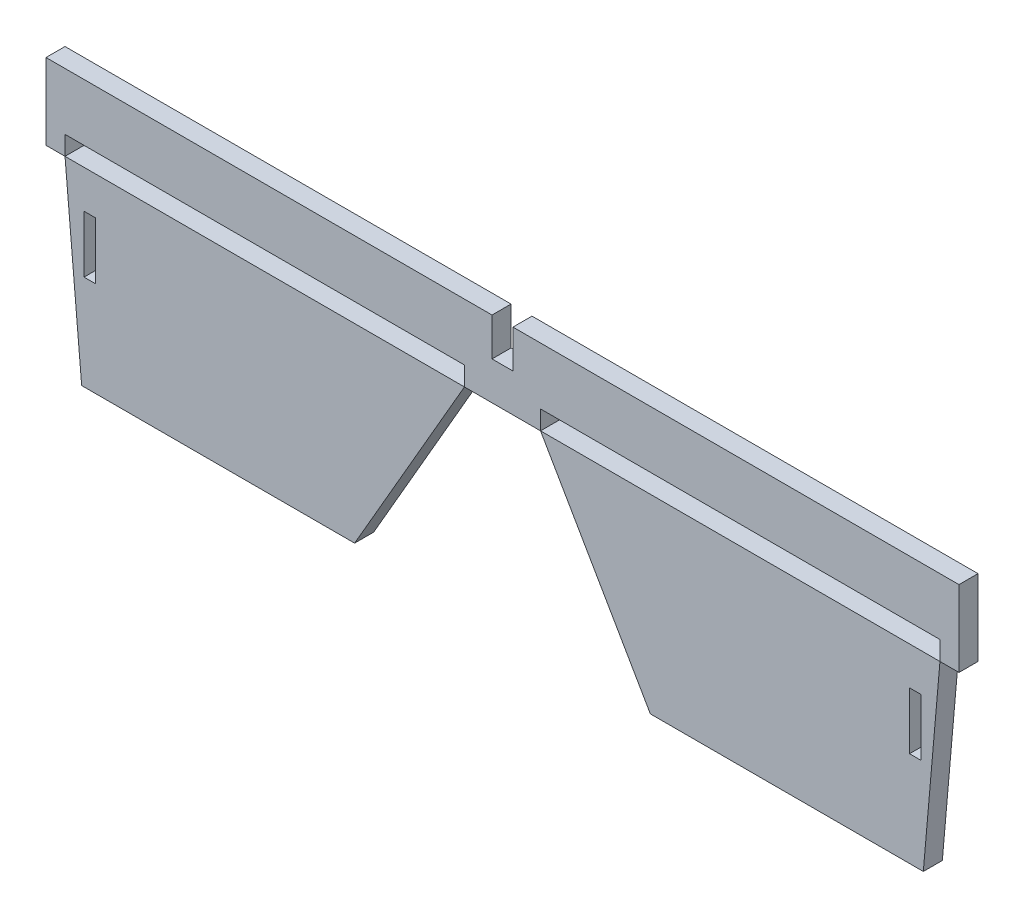
ISO-10303-21;
HEADER;
FILE_DESCRIPTION(('STEP AP214'),'2;1');
FILE_NAME('part.step','',(''),(''),'','','');
FILE_SCHEMA(('AUTOMOTIVE_DESIGN { 1 0 10303 214 1 1 1 1 }'));
ENDSEC;
DATA;
#1=APPLICATION_CONTEXT('core data for automotive mechanical design processes');
#2=APPLICATION_PROTOCOL_DEFINITION('international standard','automotive_design',2000,#1);
#3=PRODUCT_CONTEXT('',#1,'mechanical');
#4=PRODUCT('Part','Part','',(#3));
#5=PRODUCT_RELATED_PRODUCT_CATEGORY('part','',(#4));
#6=PRODUCT_DEFINITION_FORMATION('','',#4);
#7=PRODUCT_DEFINITION_CONTEXT('part definition',#1,'design');
#8=PRODUCT_DEFINITION('design','',#6,#7);
#9=PRODUCT_DEFINITION_SHAPE('','',#8);
#10=(LENGTH_UNIT() NAMED_UNIT(*) SI_UNIT(.MILLI.,.METRE.));
#11=(NAMED_UNIT(*) PLANE_ANGLE_UNIT() SI_UNIT($,.RADIAN.));
#12=(NAMED_UNIT(*) SI_UNIT($,.STERADIAN.) SOLID_ANGLE_UNIT());
#13=UNCERTAINTY_MEASURE_WITH_UNIT(LENGTH_MEASURE(1.E-05),#10,'distance_accuracy_value','');
#14=(GEOMETRIC_REPRESENTATION_CONTEXT(3) GLOBAL_UNCERTAINTY_ASSIGNED_CONTEXT((#13)) GLOBAL_UNIT_ASSIGNED_CONTEXT((#10,
#11,#12)) REPRESENTATION_CONTEXT('',''));
#15=CARTESIAN_POINT('',(0.,0.,0.));
#16=DIRECTION('',(0.,0.,1.));
#17=DIRECTION('',(1.,0.,0.));
#18=AXIS2_PLACEMENT_3D('',#15,#16,#17);
#19=CARTESIAN_POINT('',(0.,-20.,2.5));
#20=DIRECTION('',(0.,1.,0.));
#21=DIRECTION('',(0.,0.,1.));
#22=AXIS2_PLACEMENT_3D('',#19,#20,#21);
#23=PLANE('',#22);
#24=DIRECTION('',(-1.,0.,0.));
#25=VECTOR('',#24,1.);
#26=CARTESIAN_POINT('',(0.,-20.,-2.5));
#27=LINE('',#26,#25);
#28=CARTESIAN_POINT('',(110.,-20.,-2.5));
#29=VERTEX_POINT('',#28);
#30=CARTESIAN_POINT('',(107.,-20.,-2.5));
#31=VERTEX_POINT('',#30);
#32=EDGE_CURVE('E154',#29,#31,#27,.T.);
#33=ORIENTED_EDGE('',*,*,#32,.F.);
#34=DIRECTION('',(0.,0.,-1.));
#35=VECTOR('',#34,1.);
#36=CARTESIAN_POINT('',(110.,-20.,2.5));
#37=LINE('',#36,#35);
#38=CARTESIAN_POINT('',(110.,-20.,2.5));
#39=VERTEX_POINT('',#38);
#40=EDGE_CURVE('E161',#39,#29,#37,.T.);
#41=ORIENTED_EDGE('',*,*,#40,.F.);
#42=DIRECTION('',(-1.,0.,0.));
#43=VECTOR('',#42,1.);
#44=CARTESIAN_POINT('',(0.,-20.,2.5));
#45=LINE('',#44,#43);
#46=CARTESIAN_POINT('',(107.,-20.,2.5));
#47=VERTEX_POINT('',#46);
#48=EDGE_CURVE('E136',#39,#47,#45,.T.);
#49=ORIENTED_EDGE('',*,*,#48,.T.);
#50=DIRECTION('',(0.,0.,-1.));
#51=VECTOR('',#50,1.);
#52=CARTESIAN_POINT('',(107.,-20.,2.5));
#53=LINE('',#52,#51);
#54=EDGE_CURVE('E12',#47,#31,#53,.T.);
#55=ORIENTED_EDGE('',*,*,#54,.T.);
#56=EDGE_LOOP('',(#33,#41,#49,#55));
#57=FACE_BOUND('',#56,.T.);
#58=ADVANCED_FACE('F46',(#57),#23,.F.);
#59=CARTESIAN_POINT('',(107.,0.,2.5));
#60=DIRECTION('',(-1.,0.,0.));
#61=DIRECTION('',(0.,0.,-1.));
#62=AXIS2_PLACEMENT_3D('',#59,#60,#61);
#63=PLANE('',#62);
#64=DIRECTION('',(0.,-1.,0.));
#65=VECTOR('',#64,1.);
#66=CARTESIAN_POINT('',(107.,0.,-2.5));
#67=LINE('',#66,#65);
#68=CARTESIAN_POINT('',(107.,-35.,-2.5));
#69=VERTEX_POINT('',#68);
#70=EDGE_CURVE('E156',#31,#69,#67,.T.);
#71=ORIENTED_EDGE('',*,*,#70,.F.);
#72=ORIENTED_EDGE('',*,*,#54,.F.);
#73=DIRECTION('',(0.,-1.,0.));
#74=VECTOR('',#73,1.);
#75=CARTESIAN_POINT('',(107.,0.,2.5));
#76=LINE('',#75,#74);
#77=CARTESIAN_POINT('',(107.,-35.,2.5));
#78=VERTEX_POINT('',#77);
#79=EDGE_CURVE('E123',#47,#78,#76,.T.);
#80=ORIENTED_EDGE('',*,*,#79,.T.);
#81=DIRECTION('',(0.,0.,-1.));
#82=VECTOR('',#81,1.);
#83=CARTESIAN_POINT('',(107.,-35.,2.5));
#84=LINE('',#83,#82);
#85=EDGE_CURVE('E56',#78,#69,#84,.T.);
#86=ORIENTED_EDGE('',*,*,#85,.T.);
#87=EDGE_LOOP('',(#71,#72,#80,#86));
#88=FACE_BOUND('',#87,.T.);
#89=ADVANCED_FACE('F134',(#88),#63,.F.);
#90=CARTESIAN_POINT('',(0.,-35.,2.5));
#91=DIRECTION('',(0.,1.,0.));
#92=DIRECTION('',(0.,0.,1.));
#93=AXIS2_PLACEMENT_3D('',#90,#91,#92);
#94=PLANE('',#93);
#95=DIRECTION('',(-1.,0.,0.));
#96=VECTOR('',#95,1.);
#97=CARTESIAN_POINT('',(0.,-35.,-2.5));
#98=LINE('',#97,#96);
#99=CARTESIAN_POINT('',(110.,-35.,-2.5));
#100=VERTEX_POINT('',#99);
#101=EDGE_CURVE('E129',#100,#69,#98,.T.);
#102=ORIENTED_EDGE('',*,*,#101,.T.);
#103=ORIENTED_EDGE('',*,*,#85,.F.);
#104=DIRECTION('',(-1.,0.,0.));
#105=VECTOR('',#104,1.);
#106=CARTESIAN_POINT('',(0.,-35.,2.5));
#107=LINE('',#106,#105);
#108=CARTESIAN_POINT('',(110.,-35.,2.5));
#109=VERTEX_POINT('',#108);
#110=EDGE_CURVE('E119',#109,#78,#107,.T.);
#111=ORIENTED_EDGE('',*,*,#110,.F.);
#112=DIRECTION('',(0.,0.,-1.));
#113=VECTOR('',#112,1.);
#114=CARTESIAN_POINT('',(110.,-35.,2.5));
#115=LINE('',#114,#113);
#116=EDGE_CURVE('E132',#109,#100,#115,.T.);
#117=ORIENTED_EDGE('',*,*,#116,.T.);
#118=EDGE_LOOP('',(#102,#103,#111,#117));
#119=FACE_BOUND('',#118,.T.);
#120=ADVANCED_FACE('F128',(#119),#94,.T.);
#121=CARTESIAN_POINT('',(114.994686686537,-10.0607314507871,2.5));
#122=DIRECTION('',(-0.996194698091746,0.0871557427476551,0.));
#123=DIRECTION('',(0.0871557427476551,0.996194698091746,0.));
#124=AXIS2_PLACEMENT_3D('',#121,#122,#123);
#125=PLANE('',#124);
#126=DIRECTION('',(-0.0871557427476551,-0.996194698091746,0.));
#127=VECTOR('',#126,1.);
#128=CARTESIAN_POINT('',(114.994686686537,-10.0607314507871,-2.5));
#129=LINE('',#128,#127);
#130=CARTESIAN_POINT('',(115.,-10.,-2.5));
#131=VERTEX_POINT('',#130);
#132=CARTESIAN_POINT('',(110.625566823704,-60.,-2.5));
#133=VERTEX_POINT('',#132);
#134=EDGE_CURVE('E144',#131,#133,#129,.T.);
#135=ORIENTED_EDGE('',*,*,#134,.F.);
#136=DIRECTION('',(0.,0.,-1.));
#137=VECTOR('',#136,1.);
#138=CARTESIAN_POINT('',(115.,-10.,2.5));
#139=LINE('',#138,#137);
#140=CARTESIAN_POINT('',(115.,-10.,2.5));
#141=VERTEX_POINT('',#140);
#142=EDGE_CURVE('E143',#141,#131,#139,.T.);
#143=ORIENTED_EDGE('',*,*,#142,.F.);
#144=DIRECTION('',(-0.0871557427476551,-0.996194698091746,0.));
#145=VECTOR('',#144,1.);
#146=CARTESIAN_POINT('',(114.994686686537,-10.0607314507871,2.5));
#147=LINE('',#146,#145);
#148=CARTESIAN_POINT('',(110.625566823704,-60.,2.5));
#149=VERTEX_POINT('',#148);
#150=EDGE_CURVE('E160',#141,#149,#147,.T.);
#151=ORIENTED_EDGE('',*,*,#150,.T.);
#152=DIRECTION('',(0.,0.,-1.));
#153=VECTOR('',#152,1.);
#154=CARTESIAN_POINT('',(110.625566823704,-60.,2.5));
#155=LINE('',#154,#153);
#156=EDGE_CURVE('E50',#149,#133,#155,.T.);
#157=ORIENTED_EDGE('',*,*,#156,.T.);
#158=EDGE_LOOP('',(#135,#143,#151,#157));
#159=FACE_BOUND('',#158,.T.);
#160=ADVANCED_FACE('F48',(#159),#125,.F.);
#161=CARTESIAN_POINT('',(0.,-60.,2.5));
#162=DIRECTION('',(0.,1.,0.));
#163=DIRECTION('',(0.,0.,1.));
#164=AXIS2_PLACEMENT_3D('',#161,#162,#163);
#165=PLANE('',#164);
#166=DIRECTION('',(-1.,0.,0.));
#167=VECTOR('',#166,1.);
#168=CARTESIAN_POINT('',(0.,-60.,-2.5));
#169=LINE('',#168,#167);
#170=CARTESIAN_POINT('',(38.8675134594816,-60.,-2.5));
#171=VERTEX_POINT('',#170);
#172=EDGE_CURVE('E147',#133,#171,#169,.T.);
#173=ORIENTED_EDGE('',*,*,#172,.F.);
#174=ORIENTED_EDGE('',*,*,#156,.F.);
#175=DIRECTION('',(-1.,0.,0.));
#176=VECTOR('',#175,1.);
#177=CARTESIAN_POINT('',(0.,-60.,2.5));
#178=LINE('',#177,#176);
#179=CARTESIAN_POINT('',(38.8675134594816,-60.,2.5));
#180=VERTEX_POINT('',#179);
#181=EDGE_CURVE('E104',#149,#180,#178,.T.);
#182=ORIENTED_EDGE('',*,*,#181,.T.);
#183=DIRECTION('',(0.,0.,-1.));
#184=VECTOR('',#183,1.);
#185=CARTESIAN_POINT('',(38.8675134594816,-60.,2.5));
#186=LINE('',#185,#184);
#187=EDGE_CURVE('E168',#180,#171,#186,.T.);
#188=ORIENTED_EDGE('',*,*,#187,.T.);
#189=EDGE_LOOP('',(#173,#174,#182,#188));
#190=FACE_BOUND('',#189,.T.);
#191=ADVANCED_FACE('F190',(#190),#165,.F.);
#192=CARTESIAN_POINT('',(3.16987298107774,1.83012701892218,2.5));
#193=DIRECTION('',(-0.866025403784436,-0.500000000000004,0.));
#194=DIRECTION('',(-0.500000000000004,0.866025403784436,0.));
#195=AXIS2_PLACEMENT_3D('',#192,#193,#194);
#196=PLANE('',#195);
#197=DIRECTION('',(0.500000000000004,-0.866025403784436,0.));
#198=VECTOR('',#197,1.);
#199=CARTESIAN_POINT('',(3.16987298107774,1.83012701892218,-2.5));
#200=LINE('',#199,#198);
#201=CARTESIAN_POINT('',(10.,-10.,-2.5));
#202=VERTEX_POINT('',#201);
#203=EDGE_CURVE('E150',#202,#171,#200,.T.);
#204=ORIENTED_EDGE('',*,*,#203,.T.);
#205=ORIENTED_EDGE('',*,*,#187,.F.);
#206=DIRECTION('',(0.500000000000004,-0.866025403784436,0.));
#207=VECTOR('',#206,1.);
#208=CARTESIAN_POINT('',(3.16987298107774,1.83012701892218,2.5));
#209=LINE('',#208,#207);
#210=CARTESIAN_POINT('',(10.,-10.,2.5));
#211=VERTEX_POINT('',#210);
#212=EDGE_CURVE('E184',#211,#180,#209,.T.);
#213=ORIENTED_EDGE('',*,*,#212,.F.);
#214=DIRECTION('',(0.,0.,-1.));
#215=VECTOR('',#214,1.);
#216=CARTESIAN_POINT('',(10.,-10.,2.5));
#217=LINE('',#216,#215);
#218=EDGE_CURVE('E166',#211,#202,#217,.T.);
#219=ORIENTED_EDGE('',*,*,#218,.T.);
#220=EDGE_LOOP('',(#204,#205,#213,#219));
#221=FACE_BOUND('',#220,.T.);
#222=ADVANCED_FACE('F189',(#221),#196,.T.);
#223=CARTESIAN_POINT('',(0.,-10.,2.5));
#224=DIRECTION('',(0.,1.,0.));
#225=DIRECTION('',(0.,0.,1.));
#226=AXIS2_PLACEMENT_3D('',#223,#224,#225);
#227=PLANE('',#226);
#228=DIRECTION('',(-1.,0.,0.));
#229=VECTOR('',#228,1.);
#230=CARTESIAN_POINT('',(0.,-10.,-2.5));
#231=LINE('',#230,#229);
#232=EDGE_CURVE('E152',#131,#202,#231,.T.);
#233=ORIENTED_EDGE('',*,*,#232,.T.);
#234=ORIENTED_EDGE('',*,*,#218,.F.);
#235=DIRECTION('',(-1.,0.,0.));
#236=VECTOR('',#235,1.);
#237=CARTESIAN_POINT('',(0.,-10.,2.5));
#238=LINE('',#237,#236);
#239=EDGE_CURVE('E138',#141,#211,#238,.T.);
#240=ORIENTED_EDGE('',*,*,#239,.F.);
#241=ORIENTED_EDGE('',*,*,#142,.T.);
#242=EDGE_LOOP('',(#233,#234,#240,#241));
#243=FACE_BOUND('',#242,.T.);
#244=ADVANCED_FACE('F182',(#243),#227,.T.);
#245=CARTESIAN_POINT('',(110.,0.,2.5));
#246=DIRECTION('',(-1.,0.,0.));
#247=DIRECTION('',(0.,0.,-1.));
#248=AXIS2_PLACEMENT_3D('',#245,#246,#247);
#249=PLANE('',#248);
#250=DIRECTION('',(0.,-1.,0.));
#251=VECTOR('',#250,1.);
#252=CARTESIAN_POINT('',(110.,0.,-2.5));
#253=LINE('',#252,#251);
#254=EDGE_CURVE('E91',#29,#100,#253,.T.);
#255=ORIENTED_EDGE('',*,*,#254,.T.);
#256=ORIENTED_EDGE('',*,*,#116,.F.);
#257=DIRECTION('',(0.,-1.,0.));
#258=VECTOR('',#257,1.);
#259=CARTESIAN_POINT('',(110.,0.,2.5));
#260=LINE('',#259,#258);
#261=EDGE_CURVE('E65',#39,#109,#260,.T.);
#262=ORIENTED_EDGE('',*,*,#261,.F.);
#263=ORIENTED_EDGE('',*,*,#40,.T.);
#264=EDGE_LOOP('',(#255,#256,#262,#263));
#265=FACE_BOUND('',#264,.T.);
#266=ADVANCED_FACE('F208',(#265),#249,.T.);
#267=CARTESIAN_POINT('',(0.,0.,2.5));
#268=DIRECTION('',(0.,0.,1.));
#269=DIRECTION('',(-1.,0.,0.));
#270=AXIS2_PLACEMENT_3D('',#267,#268,#269);
#271=PLANE('',#270);
#272=ORIENTED_EDGE('',*,*,#150,.F.);
#273=ORIENTED_EDGE('',*,*,#239,.T.);
#274=ORIENTED_EDGE('',*,*,#212,.T.);
#275=ORIENTED_EDGE('',*,*,#181,.F.);
#276=EDGE_LOOP('',(#272,#273,#274,#275));
#277=FACE_BOUND('',#276,.T.);
#278=ORIENTED_EDGE('',*,*,#48,.F.);
#279=ORIENTED_EDGE('',*,*,#261,.T.);
#280=ORIENTED_EDGE('',*,*,#110,.T.);
#281=ORIENTED_EDGE('',*,*,#79,.F.);
#282=EDGE_LOOP('',(#278,#279,#280,#281));
#283=FACE_BOUND('',#282,.T.);
#284=ADVANCED_FACE('F121',(#277,#283),#271,.T.);
#285=CARTESIAN_POINT('',(0.,0.,-2.5));
#286=DIRECTION('',(0.,0.,1.));
#287=DIRECTION('',(-1.,0.,0.));
#288=AXIS2_PLACEMENT_3D('',#285,#286,#287);
#289=PLANE('',#288);
#290=ORIENTED_EDGE('',*,*,#134,.T.);
#291=ORIENTED_EDGE('',*,*,#172,.T.);
#292=ORIENTED_EDGE('',*,*,#203,.F.);
#293=ORIENTED_EDGE('',*,*,#232,.F.);
#294=EDGE_LOOP('',(#290,#291,#292,#293));
#295=FACE_BOUND('',#294,.T.);
#296=ORIENTED_EDGE('',*,*,#32,.T.);
#297=ORIENTED_EDGE('',*,*,#70,.T.);
#298=ORIENTED_EDGE('',*,*,#101,.F.);
#299=ORIENTED_EDGE('',*,*,#254,.F.);
#300=EDGE_LOOP('',(#296,#297,#298,#299));
#301=FACE_BOUND('',#300,.T.);
#302=ADVANCED_FACE('F178',(#295,#301),#289,.F.);
#303=CLOSED_SHELL('',(#58,#89,#120,#160,#191,#222,#244,#266,#284,#302));
#304=MANIFOLD_SOLID_BREP('B2',#303);
#305=CARTESIAN_POINT('',(0.,-20.,2.5));
#306=DIRECTION('',(0.,1.,0.));
#307=DIRECTION('',(0.,0.,1.));
#308=AXIS2_PLACEMENT_3D('',#305,#306,#307);
#309=PLANE('',#308);
#310=DIRECTION('',(1.,0.,0.));
#311=VECTOR('',#310,1.);
#312=CARTESIAN_POINT('',(0.,-20.,-2.5));
#313=LINE('',#312,#311);
#314=CARTESIAN_POINT('',(-110.,-20.,-2.5));
#315=VERTEX_POINT('',#314);
#316=CARTESIAN_POINT('',(-107.,-20.,-2.5));
#317=VERTEX_POINT('',#316);
#318=EDGE_CURVE('E400',#315,#317,#313,.T.);
#319=ORIENTED_EDGE('',*,*,#318,.T.);
#320=DIRECTION('',(0.,0.,-1.));
#321=VECTOR('',#320,1.);
#322=CARTESIAN_POINT('',(-107.,-20.,2.5));
#323=LINE('',#322,#321);
#324=CARTESIAN_POINT('',(-107.,-20.,2.5));
#325=VERTEX_POINT('',#324);
#326=EDGE_CURVE('E44',#325,#317,#323,.T.);
#327=ORIENTED_EDGE('',*,*,#326,.F.);
#328=DIRECTION('',(1.,0.,0.));
#329=VECTOR('',#328,1.);
#330=CARTESIAN_POINT('',(0.,-20.,2.5));
#331=LINE('',#330,#329);
#332=CARTESIAN_POINT('',(-110.,-20.,2.5));
#333=VERTEX_POINT('',#332);
#334=EDGE_CURVE('E371',#333,#325,#331,.T.);
#335=ORIENTED_EDGE('',*,*,#334,.F.);
#336=DIRECTION('',(0.,0.,-1.));
#337=VECTOR('',#336,1.);
#338=CARTESIAN_POINT('',(-110.,-20.,2.5));
#339=LINE('',#338,#337);
#340=EDGE_CURVE('E310',#333,#315,#339,.T.);
#341=ORIENTED_EDGE('',*,*,#340,.T.);
#342=EDGE_LOOP('',(#319,#327,#335,#341));
#343=FACE_BOUND('',#342,.T.);
#344=ADVANCED_FACE('F291',(#343),#309,.F.);
#345=CARTESIAN_POINT('',(-107.,0.,2.5));
#346=DIRECTION('',(1.,0.,0.));
#347=DIRECTION('',(0.,0.,-1.));
#348=AXIS2_PLACEMENT_3D('',#345,#346,#347);
#349=PLANE('',#348);
#350=DIRECTION('',(0.,-1.,0.));
#351=VECTOR('',#350,1.);
#352=CARTESIAN_POINT('',(-107.,0.,-2.5));
#353=LINE('',#352,#351);
#354=CARTESIAN_POINT('',(-107.,-35.,-2.5));
#355=VERTEX_POINT('',#354);
#356=EDGE_CURVE('E377',#317,#355,#353,.T.);
#357=ORIENTED_EDGE('',*,*,#356,.T.);
#358=DIRECTION('',(0.,0.,-1.));
#359=VECTOR('',#358,1.);
#360=CARTESIAN_POINT('',(-107.,-35.,2.5));
#361=LINE('',#360,#359);
#362=CARTESIAN_POINT('',(-107.,-35.,2.5));
#363=VERTEX_POINT('',#362);
#364=EDGE_CURVE('E301',#363,#355,#361,.T.);
#365=ORIENTED_EDGE('',*,*,#364,.F.);
#366=DIRECTION('',(0.,-1.,0.));
#367=VECTOR('',#366,1.);
#368=CARTESIAN_POINT('',(-107.,0.,2.5));
#369=LINE('',#368,#367);
#370=EDGE_CURVE('E365',#325,#363,#369,.T.);
#371=ORIENTED_EDGE('',*,*,#370,.F.);
#372=ORIENTED_EDGE('',*,*,#326,.T.);
#373=EDGE_LOOP('',(#357,#365,#371,#372));
#374=FACE_BOUND('',#373,.T.);
#375=ADVANCED_FACE('F376',(#374),#349,.F.);
#376=CARTESIAN_POINT('',(0.,-35.,2.5));
#377=DIRECTION('',(0.,1.,0.));
#378=DIRECTION('',(0.,0.,1.));
#379=AXIS2_PLACEMENT_3D('',#376,#377,#378);
#380=PLANE('',#379);
#381=DIRECTION('',(1.,0.,0.));
#382=VECTOR('',#381,1.);
#383=CARTESIAN_POINT('',(0.,-35.,-2.5));
#384=LINE('',#383,#382);
#385=CARTESIAN_POINT('',(-110.,-35.,-2.5));
#386=VERTEX_POINT('',#385);
#387=EDGE_CURVE('E403',#386,#355,#384,.T.);
#388=ORIENTED_EDGE('',*,*,#387,.F.);
#389=DIRECTION('',(0.,0.,-1.));
#390=VECTOR('',#389,1.);
#391=CARTESIAN_POINT('',(-110.,-35.,2.5));
#392=LINE('',#391,#390);
#393=CARTESIAN_POINT('',(-110.,-35.,2.5));
#394=VERTEX_POINT('',#393);
#395=EDGE_CURVE('E336',#394,#386,#392,.T.);
#396=ORIENTED_EDGE('',*,*,#395,.F.);
#397=DIRECTION('',(1.,0.,0.));
#398=VECTOR('',#397,1.);
#399=CARTESIAN_POINT('',(0.,-35.,2.5));
#400=LINE('',#399,#398);
#401=EDGE_CURVE('E370',#394,#363,#400,.T.);
#402=ORIENTED_EDGE('',*,*,#401,.T.);
#403=ORIENTED_EDGE('',*,*,#364,.T.);
#404=EDGE_LOOP('',(#388,#396,#402,#403));
#405=FACE_BOUND('',#404,.T.);
#406=ADVANCED_FACE('F381',(#405),#380,.T.);
#407=CARTESIAN_POINT('',(-114.994686686537,-10.0607314507871,2.5));
#408=DIRECTION('',(0.996194698091746,0.0871557427476551,0.));
#409=DIRECTION('',(-0.0871557427476551,0.996194698091746,0.));
#410=AXIS2_PLACEMENT_3D('',#407,#408,#409);
#411=PLANE('',#410);
#412=DIRECTION('',(0.0871557427476551,-0.996194698091746,0.));
#413=VECTOR('',#412,1.);
#414=CARTESIAN_POINT('',(-114.994686686537,-10.0607314507871,-2.5));
#415=LINE('',#414,#413);
#416=CARTESIAN_POINT('',(-115.,-10.,-2.5));
#417=VERTEX_POINT('',#416);
#418=CARTESIAN_POINT('',(-110.625566823704,-60.,-2.5));
#419=VERTEX_POINT('',#418);
#420=EDGE_CURVE('E388',#417,#419,#415,.T.);
#421=ORIENTED_EDGE('',*,*,#420,.T.);
#422=DIRECTION('',(0.,0.,-1.));
#423=VECTOR('',#422,1.);
#424=CARTESIAN_POINT('',(-110.625566823704,-60.,2.5));
#425=LINE('',#424,#423);
#426=CARTESIAN_POINT('',(-110.625566823704,-60.,2.5));
#427=VERTEX_POINT('',#426);
#428=EDGE_CURVE('E295',#427,#419,#425,.T.);
#429=ORIENTED_EDGE('',*,*,#428,.F.);
#430=DIRECTION('',(0.0871557427476551,-0.996194698091746,0.));
#431=VECTOR('',#430,1.);
#432=CARTESIAN_POINT('',(-114.994686686537,-10.0607314507871,2.5));
#433=LINE('',#432,#431);
#434=CARTESIAN_POINT('',(-115.,-10.,2.5));
#435=VERTEX_POINT('',#434);
#436=EDGE_CURVE('E408',#435,#427,#433,.T.);
#437=ORIENTED_EDGE('',*,*,#436,.F.);
#438=DIRECTION('',(0.,0.,-1.));
#439=VECTOR('',#438,1.);
#440=CARTESIAN_POINT('',(-115.,-10.,2.5));
#441=LINE('',#440,#439);
#442=EDGE_CURVE('E384',#435,#417,#441,.T.);
#443=ORIENTED_EDGE('',*,*,#442,.T.);
#444=EDGE_LOOP('',(#421,#429,#437,#443));
#445=FACE_BOUND('',#444,.T.);
#446=ADVANCED_FACE('F293',(#445),#411,.F.);
#447=CARTESIAN_POINT('',(0.,-60.,2.5));
#448=DIRECTION('',(0.,1.,0.));
#449=DIRECTION('',(0.,0.,1.));
#450=AXIS2_PLACEMENT_3D('',#447,#448,#449);
#451=PLANE('',#450);
#452=DIRECTION('',(1.,0.,0.));
#453=VECTOR('',#452,1.);
#454=CARTESIAN_POINT('',(0.,-60.,-2.5));
#455=LINE('',#454,#453);
#456=CARTESIAN_POINT('',(-38.8675134594816,-60.,-2.5));
#457=VERTEX_POINT('',#456);
#458=EDGE_CURVE('E391',#419,#457,#455,.T.);
#459=ORIENTED_EDGE('',*,*,#458,.T.);
#460=DIRECTION('',(0.,0.,-1.));
#461=VECTOR('',#460,1.);
#462=CARTESIAN_POINT('',(-38.8675134594816,-60.,2.5));
#463=LINE('',#462,#461);
#464=CARTESIAN_POINT('',(-38.8675134594816,-60.,2.5));
#465=VERTEX_POINT('',#464);
#466=EDGE_CURVE('E413',#465,#457,#463,.T.);
#467=ORIENTED_EDGE('',*,*,#466,.F.);
#468=DIRECTION('',(1.,0.,0.));
#469=VECTOR('',#468,1.);
#470=CARTESIAN_POINT('',(0.,-60.,2.5));
#471=LINE('',#470,#469);
#472=EDGE_CURVE('E349',#427,#465,#471,.T.);
#473=ORIENTED_EDGE('',*,*,#472,.F.);
#474=ORIENTED_EDGE('',*,*,#428,.T.);
#475=EDGE_LOOP('',(#459,#467,#473,#474));
#476=FACE_BOUND('',#475,.T.);
#477=ADVANCED_FACE('F418',(#476),#451,.F.);
#478=CARTESIAN_POINT('',(-3.16987298107774,1.83012701892218,2.5));
#479=DIRECTION('',(0.866025403784436,-0.500000000000004,0.));
#480=DIRECTION('',(0.500000000000004,0.866025403784436,0.));
#481=AXIS2_PLACEMENT_3D('',#478,#479,#480);
#482=PLANE('',#481);
#483=DIRECTION('',(-0.500000000000004,-0.866025403784436,0.));
#484=VECTOR('',#483,1.);
#485=CARTESIAN_POINT('',(-3.16987298107774,1.83012701892218,-2.5));
#486=LINE('',#485,#484);
#487=CARTESIAN_POINT('',(-10.,-10.,-2.5));
#488=VERTEX_POINT('',#487);
#489=EDGE_CURVE('E394',#488,#457,#486,.T.);
#490=ORIENTED_EDGE('',*,*,#489,.F.);
#491=DIRECTION('',(0.,0.,-1.));
#492=VECTOR('',#491,1.);
#493=CARTESIAN_POINT('',(-10.,-10.,2.5));
#494=LINE('',#493,#492);
#495=CARTESIAN_POINT('',(-10.,-10.,2.5));
#496=VERTEX_POINT('',#495);
#497=EDGE_CURVE('E412',#496,#488,#494,.T.);
#498=ORIENTED_EDGE('',*,*,#497,.F.);
#499=DIRECTION('',(-0.500000000000004,-0.866025403784436,0.));
#500=VECTOR('',#499,1.);
#501=CARTESIAN_POINT('',(-3.16987298107774,1.83012701892218,2.5));
#502=LINE('',#501,#500);
#503=EDGE_CURVE('E459',#496,#465,#502,.T.);
#504=ORIENTED_EDGE('',*,*,#503,.T.);
#505=ORIENTED_EDGE('',*,*,#466,.T.);
#506=EDGE_LOOP('',(#490,#498,#504,#505));
#507=FACE_BOUND('',#506,.T.);
#508=ADVANCED_FACE('F432',(#507),#482,.T.);
#509=CARTESIAN_POINT('',(0.,-10.,2.5));
#510=DIRECTION('',(0.,1.,0.));
#511=DIRECTION('',(0.,0.,1.));
#512=AXIS2_PLACEMENT_3D('',#509,#510,#511);
#513=PLANE('',#512);
#514=DIRECTION('',(1.,0.,0.));
#515=VECTOR('',#514,1.);
#516=CARTESIAN_POINT('',(0.,-10.,-2.5));
#517=LINE('',#516,#515);
#518=EDGE_CURVE('E397',#417,#488,#517,.T.);
#519=ORIENTED_EDGE('',*,*,#518,.F.);
#520=ORIENTED_EDGE('',*,*,#442,.F.);
#521=DIRECTION('',(1.,0.,0.));
#522=VECTOR('',#521,1.);
#523=CARTESIAN_POINT('',(0.,-10.,2.5));
#524=LINE('',#523,#522);
#525=EDGE_CURVE('E430',#435,#496,#524,.T.);
#526=ORIENTED_EDGE('',*,*,#525,.T.);
#527=ORIENTED_EDGE('',*,*,#497,.T.);
#528=EDGE_LOOP('',(#519,#520,#526,#527));
#529=FACE_BOUND('',#528,.T.);
#530=ADVANCED_FACE('F427',(#529),#513,.T.);
#531=CARTESIAN_POINT('',(-110.,0.,2.5));
#532=DIRECTION('',(1.,0.,0.));
#533=DIRECTION('',(0.,0.,-1.));
#534=AXIS2_PLACEMENT_3D('',#531,#532,#533);
#535=PLANE('',#534);
#536=DIRECTION('',(0.,-1.,0.));
#537=VECTOR('',#536,1.);
#538=CARTESIAN_POINT('',(-110.,0.,-2.5));
#539=LINE('',#538,#537);
#540=EDGE_CURVE('E405',#315,#386,#539,.T.);
#541=ORIENTED_EDGE('',*,*,#540,.F.);
#542=ORIENTED_EDGE('',*,*,#340,.F.);
#543=DIRECTION('',(0.,-1.,0.));
#544=VECTOR('',#543,1.);
#545=CARTESIAN_POINT('',(-110.,0.,2.5));
#546=LINE('',#545,#544);
#547=EDGE_CURVE('E382',#333,#394,#546,.T.);
#548=ORIENTED_EDGE('',*,*,#547,.T.);
#549=ORIENTED_EDGE('',*,*,#395,.T.);
#550=EDGE_LOOP('',(#541,#542,#548,#549));
#551=FACE_BOUND('',#550,.T.);
#552=ADVANCED_FACE('F439',(#551),#535,.T.);
#553=CARTESIAN_POINT('',(0.,0.,2.5));
#554=DIRECTION('',(0.,0.,1.));
#555=DIRECTION('',(1.,0.,0.));
#556=AXIS2_PLACEMENT_3D('',#553,#554,#555);
#557=PLANE('',#556);
#558=ORIENTED_EDGE('',*,*,#436,.T.);
#559=ORIENTED_EDGE('',*,*,#472,.T.);
#560=ORIENTED_EDGE('',*,*,#503,.F.);
#561=ORIENTED_EDGE('',*,*,#525,.F.);
#562=EDGE_LOOP('',(#558,#559,#560,#561));
#563=FACE_BOUND('',#562,.T.);
#564=ORIENTED_EDGE('',*,*,#334,.T.);
#565=ORIENTED_EDGE('',*,*,#370,.T.);
#566=ORIENTED_EDGE('',*,*,#401,.F.);
#567=ORIENTED_EDGE('',*,*,#547,.F.);
#568=EDGE_LOOP('',(#564,#565,#566,#567));
#569=FACE_BOUND('',#568,.T.);
#570=ADVANCED_FACE('F367',(#563,#569),#557,.T.);
#571=CARTESIAN_POINT('',(0.,0.,-2.5));
#572=DIRECTION('',(0.,0.,1.));
#573=DIRECTION('',(1.,0.,0.));
#574=AXIS2_PLACEMENT_3D('',#571,#572,#573);
#575=PLANE('',#574);
#576=ORIENTED_EDGE('',*,*,#420,.F.);
#577=ORIENTED_EDGE('',*,*,#518,.T.);
#578=ORIENTED_EDGE('',*,*,#489,.T.);
#579=ORIENTED_EDGE('',*,*,#458,.F.);
#580=EDGE_LOOP('',(#576,#577,#578,#579));
#581=FACE_BOUND('',#580,.T.);
#582=ORIENTED_EDGE('',*,*,#318,.F.);
#583=ORIENTED_EDGE('',*,*,#540,.T.);
#584=ORIENTED_EDGE('',*,*,#387,.T.);
#585=ORIENTED_EDGE('',*,*,#356,.F.);
#586=EDGE_LOOP('',(#582,#583,#584,#585));
#587=FACE_BOUND('',#586,.T.);
#588=ADVANCED_FACE('F424',(#581,#587),#575,.F.);
#589=CLOSED_SHELL('',(#344,#375,#406,#446,#477,#508,#530,#552,#570,#588));
#590=MANIFOLD_SOLID_BREP('B6',#589);
#591=CARTESIAN_POINT('',(-10.,0.,2.5));
#592=DIRECTION('',(-1.,0.,0.));
#593=DIRECTION('',(0.,-1.,0.));
#594=AXIS2_PLACEMENT_3D('',#591,#592,#593);
#595=PLANE('',#594);
#596=DIRECTION('',(0.,1.,0.));
#597=VECTOR('',#596,1.);
#598=CARTESIAN_POINT('',(-10.,0.,-2.5));
#599=LINE('',#598,#597);
#600=CARTESIAN_POINT('',(-10.,-10.,-2.5));
#601=VERTEX_POINT('',#600);
#602=CARTESIAN_POINT('',(-10.,-5.,-2.5));
#603=VERTEX_POINT('',#602);
#604=EDGE_CURVE('E627',#601,#603,#599,.T.);
#605=ORIENTED_EDGE('',*,*,#604,.F.);
#606=DIRECTION('',(0.,0.,-1.));
#607=VECTOR('',#606,1.);
#608=CARTESIAN_POINT('',(-10.,-10.,2.5));
#609=LINE('',#608,#607);
#610=CARTESIAN_POINT('',(-10.,-10.,2.5));
#611=VERTEX_POINT('',#610);
#612=EDGE_CURVE('E289',#611,#601,#609,.T.);
#613=ORIENTED_EDGE('',*,*,#612,.F.);
#614=DIRECTION('',(0.,1.,0.));
#615=VECTOR('',#614,1.);
#616=CARTESIAN_POINT('',(-10.,0.,2.5));
#617=LINE('',#616,#615);
#618=CARTESIAN_POINT('',(-10.,-5.,2.5));
#619=VERTEX_POINT('',#618);
#620=EDGE_CURVE('E648',#611,#619,#617,.T.);
#621=ORIENTED_EDGE('',*,*,#620,.T.);
#622=DIRECTION('',(0.,0.,-1.));
#623=VECTOR('',#622,1.);
#624=CARTESIAN_POINT('',(-10.,-5.,2.5));
#625=LINE('',#624,#623);
#626=EDGE_CURVE('E579',#619,#603,#625,.T.);
#627=ORIENTED_EDGE('',*,*,#626,.T.);
#628=EDGE_LOOP('',(#605,#613,#621,#627));
#629=FACE_BOUND('',#628,.T.);
#630=ADVANCED_FACE('F527',(#629),#595,.T.);
#631=CARTESIAN_POINT('',(0.,-10.,2.5));
#632=DIRECTION('',(0.,1.,0.));
#633=DIRECTION('',(0.,0.,1.));
#634=AXIS2_PLACEMENT_3D('',#631,#632,#633);
#635=PLANE('',#634);
#636=DIRECTION('',(1.,0.,0.));
#637=VECTOR('',#636,1.);
#638=CARTESIAN_POINT('',(0.,-10.,-2.5));
#639=LINE('',#638,#637);
#640=CARTESIAN_POINT('',(10.,-10.,-2.5));
#641=VERTEX_POINT('',#640);
#642=EDGE_CURVE('E630',#601,#641,#639,.T.);
#643=ORIENTED_EDGE('',*,*,#642,.T.);
#644=DIRECTION('',(0.,0.,-1.));
#645=VECTOR('',#644,1.);
#646=CARTESIAN_POINT('',(10.,-10.,2.5));
#647=LINE('',#646,#645);
#648=CARTESIAN_POINT('',(10.,-10.,2.5));
#649=VERTEX_POINT('',#648);
#650=EDGE_CURVE('E631',#649,#641,#647,.T.);
#651=ORIENTED_EDGE('',*,*,#650,.F.);
#652=DIRECTION('',(1.,0.,0.));
#653=VECTOR('',#652,1.);
#654=CARTESIAN_POINT('',(0.,-10.,2.5));
#655=LINE('',#654,#653);
#656=EDGE_CURVE('E613',#611,#649,#655,.T.);
#657=ORIENTED_EDGE('',*,*,#656,.F.);
#658=ORIENTED_EDGE('',*,*,#612,.T.);
#659=EDGE_LOOP('',(#643,#651,#657,#658));
#660=FACE_BOUND('',#659,.T.);
#661=ADVANCED_FACE('F816',(#660),#635,.F.);
#662=CARTESIAN_POINT('',(0.,0.,2.5));
#663=DIRECTION('',(0.,1.,0.));
#664=DIRECTION('',(0.,0.,1.));
#665=AXIS2_PLACEMENT_3D('',#662,#663,#664);
#666=PLANE('',#665);
#667=DIRECTION('',(1.,0.,0.));
#668=VECTOR('',#667,1.);
#669=CARTESIAN_POINT('',(0.,0.,-2.5));
#670=LINE('',#669,#668);
#671=CARTESIAN_POINT('',(-2.75,0.,-2.5));
#672=VERTEX_POINT('',#671);
#673=CARTESIAN_POINT('',(2.75,0.,-2.5));
#674=VERTEX_POINT('',#673);
#675=EDGE_CURVE('E634',#672,#674,#670,.T.);
#676=ORIENTED_EDGE('',*,*,#675,.F.);
#677=DIRECTION('',(0.,0.,-1.));
#678=VECTOR('',#677,1.);
#679=CARTESIAN_POINT('',(-2.75,0.,2.5));
#680=LINE('',#679,#678);
#681=CARTESIAN_POINT('',(-2.75,0.,2.5));
#682=VERTEX_POINT('',#681);
#683=EDGE_CURVE('E535',#682,#672,#680,.T.);
#684=ORIENTED_EDGE('',*,*,#683,.F.);
#685=DIRECTION('',(1.,0.,0.));
#686=VECTOR('',#685,1.);
#687=CARTESIAN_POINT('',(0.,0.,2.5));
#688=LINE('',#687,#686);
#689=CARTESIAN_POINT('',(2.75,0.,2.5));
#690=VERTEX_POINT('',#689);
#691=EDGE_CURVE('E681',#682,#690,#688,.T.);
#692=ORIENTED_EDGE('',*,*,#691,.T.);
#693=DIRECTION('',(0.,0.,-1.));
#694=VECTOR('',#693,1.);
#695=CARTESIAN_POINT('',(2.75,0.,2.5));
#696=LINE('',#695,#694);
#697=EDGE_CURVE('E669',#690,#674,#696,.T.);
#698=ORIENTED_EDGE('',*,*,#697,.T.);
#699=EDGE_LOOP('',(#676,#684,#692,#698));
#700=FACE_BOUND('',#699,.T.);
#701=ADVANCED_FACE('F666',(#700),#666,.T.);
#702=CARTESIAN_POINT('',(-2.75,0.,2.5));
#703=DIRECTION('',(1.,0.,0.));
#704=DIRECTION('',(0.,1.,0.));
#705=AXIS2_PLACEMENT_3D('',#702,#703,#704);
#706=PLANE('',#705);
#707=DIRECTION('',(0.,-1.,0.));
#708=VECTOR('',#707,1.);
#709=CARTESIAN_POINT('',(-2.75,0.,-2.5));
#710=LINE('',#709,#708);
#711=CARTESIAN_POINT('',(-2.75,10.,-2.5));
#712=VERTEX_POINT('',#711);
#713=EDGE_CURVE('E637',#712,#672,#710,.T.);
#714=ORIENTED_EDGE('',*,*,#713,.F.);
#715=DIRECTION('',(0.,0.,-1.));
#716=VECTOR('',#715,1.);
#717=CARTESIAN_POINT('',(-2.75,10.,2.5));
#718=LINE('',#717,#716);
#719=CARTESIAN_POINT('',(-2.75,10.,2.5));
#720=VERTEX_POINT('',#719);
#721=EDGE_CURVE('E654',#720,#712,#718,.T.);
#722=ORIENTED_EDGE('',*,*,#721,.F.);
#723=DIRECTION('',(0.,-1.,0.));
#724=VECTOR('',#723,1.);
#725=CARTESIAN_POINT('',(-2.75,0.,2.5));
#726=LINE('',#725,#724);
#727=EDGE_CURVE('E661',#720,#682,#726,.T.);
#728=ORIENTED_EDGE('',*,*,#727,.T.);
#729=ORIENTED_EDGE('',*,*,#683,.T.);
#730=EDGE_LOOP('',(#714,#722,#728,#729));
#731=FACE_BOUND('',#730,.T.);
#732=ADVANCED_FACE('F659',(#731),#706,.T.);
#733=CARTESIAN_POINT('',(0.,10.,2.5));
#734=DIRECTION('',(0.,1.,0.));
#735=DIRECTION('',(0.,0.,1.));
#736=AXIS2_PLACEMENT_3D('',#733,#734,#735);
#737=PLANE('',#736);
#738=DIRECTION('',(1.,0.,0.));
#739=VECTOR('',#738,1.);
#740=CARTESIAN_POINT('',(0.,10.,-2.5));
#741=LINE('',#740,#739);
#742=CARTESIAN_POINT('',(-120.,10.,-2.5));
#743=VERTEX_POINT('',#742);
#744=EDGE_CURVE('E640',#743,#712,#741,.T.);
#745=ORIENTED_EDGE('',*,*,#744,.F.);
#746=DIRECTION('',(0.,0.,-1.));
#747=VECTOR('',#746,1.);
#748=CARTESIAN_POINT('',(-120.,10.,2.5));
#749=LINE('',#748,#747);
#750=CARTESIAN_POINT('',(-120.,10.,2.5));
#751=VERTEX_POINT('',#750);
#752=EDGE_CURVE('E652',#751,#743,#749,.T.);
#753=ORIENTED_EDGE('',*,*,#752,.F.);
#754=DIRECTION('',(1.,0.,0.));
#755=VECTOR('',#754,1.);
#756=CARTESIAN_POINT('',(0.,10.,2.5));
#757=LINE('',#756,#755);
#758=EDGE_CURVE('E679',#751,#720,#757,.T.);
#759=ORIENTED_EDGE('',*,*,#758,.T.);
#760=ORIENTED_EDGE('',*,*,#721,.T.);
#761=EDGE_LOOP('',(#745,#753,#759,#760));
#762=FACE_BOUND('',#761,.T.);
#763=ADVANCED_FACE('F677',(#762),#737,.T.);
#764=CARTESIAN_POINT('',(-120.,0.,2.5));
#765=DIRECTION('',(1.,0.,0.));
#766=DIRECTION('',(0.,0.,-1.));
#767=AXIS2_PLACEMENT_3D('',#764,#765,#766);
#768=PLANE('',#767);
#769=DIRECTION('',(0.,-1.,0.));
#770=VECTOR('',#769,1.);
#771=CARTESIAN_POINT('',(-120.,0.,-2.5));
#772=LINE('',#771,#770);
#773=CARTESIAN_POINT('',(-120.,-10.,-2.5));
#774=VERTEX_POINT('',#773);
#775=EDGE_CURVE('E643',#743,#774,#772,.T.);
#776=ORIENTED_EDGE('',*,*,#775,.T.);
#777=DIRECTION('',(0.,0.,-1.));
#778=VECTOR('',#777,1.);
#779=CARTESIAN_POINT('',(-120.,-10.,2.5));
#780=LINE('',#779,#778);
#781=CARTESIAN_POINT('',(-120.,-10.,2.5));
#782=VERTEX_POINT('',#781);
#783=EDGE_CURVE('E618',#782,#774,#780,.T.);
#784=ORIENTED_EDGE('',*,*,#783,.F.);
#785=DIRECTION('',(0.,-1.,0.));
#786=VECTOR('',#785,1.);
#787=CARTESIAN_POINT('',(-120.,0.,2.5));
#788=LINE('',#787,#786);
#789=EDGE_CURVE('E608',#751,#782,#788,.T.);
#790=ORIENTED_EDGE('',*,*,#789,.F.);
#791=ORIENTED_EDGE('',*,*,#752,.T.);
#792=EDGE_LOOP('',(#776,#784,#790,#791));
#793=FACE_BOUND('',#792,.T.);
#794=ADVANCED_FACE('F838',(#793),#768,.F.);
#795=CARTESIAN_POINT('',(-115.,-10.,-2.5));
#796=VERTEX_POINT('',#795);
#797=EDGE_CURVE('E617',#774,#796,#639,.T.);
#798=ORIENTED_EDGE('',*,*,#797,.T.);
#799=DIRECTION('',(0.,0.,-1.));
#800=VECTOR('',#799,1.);
#801=CARTESIAN_POINT('',(-115.,-10.,2.5));
#802=LINE('',#801,#800);
#803=CARTESIAN_POINT('',(-115.,-10.,2.5));
#804=VERTEX_POINT('',#803);
#805=EDGE_CURVE('E614',#804,#796,#802,.T.);
#806=ORIENTED_EDGE('',*,*,#805,.F.);
#807=EDGE_CURVE('E601',#782,#804,#655,.T.);
#808=ORIENTED_EDGE('',*,*,#807,.F.);
#809=ORIENTED_EDGE('',*,*,#783,.T.);
#810=EDGE_LOOP('',(#798,#806,#808,#809));
#811=FACE_BOUND('',#810,.T.);
#812=ADVANCED_FACE('F615',(#811),#635,.F.);
#813=CARTESIAN_POINT('',(-115.,0.,2.5));
#814=DIRECTION('',(-1.,0.,0.));
#815=DIRECTION('',(0.,0.,1.));
#816=AXIS2_PLACEMENT_3D('',#813,#814,#815);
#817=PLANE('',#816);
#818=DIRECTION('',(0.,1.,0.));
#819=VECTOR('',#818,1.);
#820=CARTESIAN_POINT('',(-115.,0.,-2.5));
#821=LINE('',#820,#819);
#822=CARTESIAN_POINT('',(-115.,-5.,-2.5));
#823=VERTEX_POINT('',#822);
#824=EDGE_CURVE('E572',#796,#823,#821,.T.);
#825=ORIENTED_EDGE('',*,*,#824,.T.);
#826=DIRECTION('',(0.,0.,-1.));
#827=VECTOR('',#826,1.);
#828=CARTESIAN_POINT('',(-115.,-5.,2.5));
#829=LINE('',#828,#827);
#830=CARTESIAN_POINT('',(-115.,-5.,2.5));
#831=VERTEX_POINT('',#830);
#832=EDGE_CURVE('E619',#831,#823,#829,.T.);
#833=ORIENTED_EDGE('',*,*,#832,.F.);
#834=DIRECTION('',(0.,1.,0.));
#835=VECTOR('',#834,1.);
#836=CARTESIAN_POINT('',(-115.,0.,2.5));
#837=LINE('',#836,#835);
#838=EDGE_CURVE('E605',#804,#831,#837,.T.);
#839=ORIENTED_EDGE('',*,*,#838,.F.);
#840=ORIENTED_EDGE('',*,*,#805,.T.);
#841=EDGE_LOOP('',(#825,#833,#839,#840));
#842=FACE_BOUND('',#841,.T.);
#843=ADVANCED_FACE('F621',(#842),#817,.F.);
#844=CARTESIAN_POINT('',(0.,-5.,2.5));
#845=DIRECTION('',(0.,1.,0.));
#846=DIRECTION('',(0.,0.,1.));
#847=AXIS2_PLACEMENT_3D('',#844,#845,#846);
#848=PLANE('',#847);
#849=DIRECTION('',(1.,0.,0.));
#850=VECTOR('',#849,1.);
#851=CARTESIAN_POINT('',(0.,-5.,-2.5));
#852=LINE('',#851,#850);
#853=EDGE_CURVE('E646',#823,#603,#852,.T.);
#854=ORIENTED_EDGE('',*,*,#853,.T.);
#855=ORIENTED_EDGE('',*,*,#626,.F.);
#856=DIRECTION('',(1.,0.,0.));
#857=VECTOR('',#856,1.);
#858=CARTESIAN_POINT('',(0.,-5.,2.5));
#859=LINE('',#858,#857);
#860=EDGE_CURVE('E543',#831,#619,#859,.T.);
#861=ORIENTED_EDGE('',*,*,#860,.F.);
#862=ORIENTED_EDGE('',*,*,#832,.T.);
#863=EDGE_LOOP('',(#854,#855,#861,#862));
#864=FACE_BOUND('',#863,.T.);
#865=ADVANCED_FACE('F826',(#864),#848,.F.);
#866=CARTESIAN_POINT('',(0.,0.,2.5));
#867=DIRECTION('',(0.,0.,1.));
#868=DIRECTION('',(1.,0.,0.));
#869=AXIS2_PLACEMENT_3D('',#866,#867,#868);
#870=PLANE('',#869);
#871=ORIENTED_EDGE('',*,*,#620,.F.);
#872=ORIENTED_EDGE('',*,*,#656,.T.);
#873=DIRECTION('',(0.,1.,0.));
#874=VECTOR('',#873,1.);
#875=CARTESIAN_POINT('',(10.,0.,2.5));
#876=LINE('',#875,#874);
#877=CARTESIAN_POINT('',(10.,-5.,2.5));
#878=VERTEX_POINT('',#877);
#879=EDGE_CURVE('E712',#649,#878,#876,.T.);
#880=ORIENTED_EDGE('',*,*,#879,.T.);
#881=DIRECTION('',(-1.,0.,0.));
#882=VECTOR('',#881,1.);
#883=CARTESIAN_POINT('',(0.,-5.,2.5));
#884=LINE('',#883,#882);
#885=CARTESIAN_POINT('',(115.,-5.,2.5));
#886=VERTEX_POINT('',#885);
#887=EDGE_CURVE('E708',#886,#878,#884,.T.);
#888=ORIENTED_EDGE('',*,*,#887,.F.);
#889=DIRECTION('',(0.,1.,0.));
#890=VECTOR('',#889,1.);
#891=CARTESIAN_POINT('',(115.,0.,2.5));
#892=LINE('',#891,#890);
#893=CARTESIAN_POINT('',(115.,-10.,2.5));
#894=VERTEX_POINT('',#893);
#895=EDGE_CURVE('E732',#894,#886,#892,.T.);
#896=ORIENTED_EDGE('',*,*,#895,.F.);
#897=DIRECTION('',(-1.,0.,0.));
#898=VECTOR('',#897,1.);
#899=CARTESIAN_POINT('',(0.,-10.,2.5));
#900=LINE('',#899,#898);
#901=CARTESIAN_POINT('',(120.,-10.,2.5));
#902=VERTEX_POINT('',#901);
#903=EDGE_CURVE('E735',#902,#894,#900,.T.);
#904=ORIENTED_EDGE('',*,*,#903,.F.);
#905=DIRECTION('',(0.,-1.,0.));
#906=VECTOR('',#905,1.);
#907=CARTESIAN_POINT('',(120.,0.,2.5));
#908=LINE('',#907,#906);
#909=CARTESIAN_POINT('',(120.,10.,2.5));
#910=VERTEX_POINT('',#909);
#911=EDGE_CURVE('E736',#910,#902,#908,.T.);
#912=ORIENTED_EDGE('',*,*,#911,.F.);
#913=DIRECTION('',(-1.,0.,0.));
#914=VECTOR('',#913,1.);
#915=CARTESIAN_POINT('',(0.,10.,2.5));
#916=LINE('',#915,#914);
#917=CARTESIAN_POINT('',(2.75,10.,2.5));
#918=VERTEX_POINT('',#917);
#919=EDGE_CURVE('E739',#910,#918,#916,.T.);
#920=ORIENTED_EDGE('',*,*,#919,.T.);
#921=DIRECTION('',(0.,-1.,0.));
#922=VECTOR('',#921,1.);
#923=CARTESIAN_POINT('',(2.75,0.,2.5));
#924=LINE('',#923,#922);
#925=EDGE_CURVE('E742',#918,#690,#924,.T.);
#926=ORIENTED_EDGE('',*,*,#925,.T.);
#927=ORIENTED_EDGE('',*,*,#691,.F.);
#928=ORIENTED_EDGE('',*,*,#727,.F.);
#929=ORIENTED_EDGE('',*,*,#758,.F.);
#930=ORIENTED_EDGE('',*,*,#789,.T.);
#931=ORIENTED_EDGE('',*,*,#807,.T.);
#932=ORIENTED_EDGE('',*,*,#838,.T.);
#933=ORIENTED_EDGE('',*,*,#860,.T.);
#934=EDGE_LOOP('',(#871,#872,#880,#888,#896,#904,#912,#920,#926,#927,#928,#929,#930,#931,#932,#933));
#935=FACE_BOUND('',#934,.T.);
#936=ADVANCED_FACE('F603',(#935),#870,.T.);
#937=CARTESIAN_POINT('',(0.,0.,-2.5));
#938=DIRECTION('',(0.,0.,1.));
#939=DIRECTION('',(1.,0.,0.));
#940=AXIS2_PLACEMENT_3D('',#937,#938,#939);
#941=PLANE('',#940);
#942=ORIENTED_EDGE('',*,*,#604,.T.);
#943=ORIENTED_EDGE('',*,*,#853,.F.);
#944=ORIENTED_EDGE('',*,*,#824,.F.);
#945=ORIENTED_EDGE('',*,*,#797,.F.);
#946=ORIENTED_EDGE('',*,*,#775,.F.);
#947=ORIENTED_EDGE('',*,*,#744,.T.);
#948=ORIENTED_EDGE('',*,*,#713,.T.);
#949=ORIENTED_EDGE('',*,*,#675,.T.);
#950=DIRECTION('',(0.,-1.,0.));
#951=VECTOR('',#950,1.);
#952=CARTESIAN_POINT('',(2.75,0.,-2.5));
#953=LINE('',#952,#951);
#954=CARTESIAN_POINT('',(2.75,10.,-2.5));
#955=VERTEX_POINT('',#954);
#956=EDGE_CURVE('E723',#955,#674,#953,.T.);
#957=ORIENTED_EDGE('',*,*,#956,.F.);
#958=DIRECTION('',(-1.,0.,0.));
#959=VECTOR('',#958,1.);
#960=CARTESIAN_POINT('',(0.,10.,-2.5));
#961=LINE('',#960,#959);
#962=CARTESIAN_POINT('',(120.,10.,-2.5));
#963=VERTEX_POINT('',#962);
#964=EDGE_CURVE('E720',#963,#955,#961,.T.);
#965=ORIENTED_EDGE('',*,*,#964,.F.);
#966=DIRECTION('',(0.,-1.,0.));
#967=VECTOR('',#966,1.);
#968=CARTESIAN_POINT('',(120.,0.,-2.5));
#969=LINE('',#968,#967);
#970=CARTESIAN_POINT('',(120.,-10.,-2.5));
#971=VERTEX_POINT('',#970);
#972=EDGE_CURVE('E717',#963,#971,#969,.T.);
#973=ORIENTED_EDGE('',*,*,#972,.T.);
#974=DIRECTION('',(-1.,0.,0.));
#975=VECTOR('',#974,1.);
#976=CARTESIAN_POINT('',(0.,-10.,-2.5));
#977=LINE('',#976,#975);
#978=CARTESIAN_POINT('',(115.,-10.,-2.5));
#979=VERTEX_POINT('',#978);
#980=EDGE_CURVE('E716',#971,#979,#977,.T.);
#981=ORIENTED_EDGE('',*,*,#980,.T.);
#982=DIRECTION('',(0.,1.,0.));
#983=VECTOR('',#982,1.);
#984=CARTESIAN_POINT('',(115.,0.,-2.5));
#985=LINE('',#984,#983);
#986=CARTESIAN_POINT('',(115.,-5.,-2.5));
#987=VERTEX_POINT('',#986);
#988=EDGE_CURVE('E713',#979,#987,#985,.T.);
#989=ORIENTED_EDGE('',*,*,#988,.T.);
#990=DIRECTION('',(-1.,0.,0.));
#991=VECTOR('',#990,1.);
#992=CARTESIAN_POINT('',(0.,-5.,-2.5));
#993=LINE('',#992,#991);
#994=CARTESIAN_POINT('',(10.,-5.,-2.5));
#995=VERTEX_POINT('',#994);
#996=EDGE_CURVE('E709',#987,#995,#993,.T.);
#997=ORIENTED_EDGE('',*,*,#996,.T.);
#998=DIRECTION('',(0.,1.,0.));
#999=VECTOR('',#998,1.);
#1000=CARTESIAN_POINT('',(10.,0.,-2.5));
#1001=LINE('',#1000,#999);
#1002=EDGE_CURVE('E725',#641,#995,#1001,.T.);
#1003=ORIENTED_EDGE('',*,*,#1002,.F.);
#1004=ORIENTED_EDGE('',*,*,#642,.F.);
#1005=EDGE_LOOP('',(#942,#943,#944,#945,#946,#947,#948,#949,#957,#965,#973,#981,#989,#997,#1003,#1004));
#1006=FACE_BOUND('',#1005,.T.);
#1007=ADVANCED_FACE('F673',(#1006),#941,.F.);
#1008=CARTESIAN_POINT('',(10.,0.,2.5));
#1009=DIRECTION('',(1.,0.,0.));
#1010=DIRECTION('',(0.,-1.,0.));
#1011=AXIS2_PLACEMENT_3D('',#1008,#1009,#1010);
#1012=PLANE('',#1011);
#1013=ORIENTED_EDGE('',*,*,#1002,.T.);
#1014=DIRECTION('',(0.,0.,-1.));
#1015=VECTOR('',#1014,1.);
#1016=CARTESIAN_POINT('',(10.,-5.,2.5));
#1017=LINE('',#1016,#1015);
#1018=EDGE_CURVE('E705',#878,#995,#1017,.T.);
#1019=ORIENTED_EDGE('',*,*,#1018,.F.);
#1020=ORIENTED_EDGE('',*,*,#879,.F.);
#1021=ORIENTED_EDGE('',*,*,#650,.T.);
#1022=EDGE_LOOP('',(#1013,#1019,#1020,#1021));
#1023=FACE_BOUND('',#1022,.T.);
#1024=ADVANCED_FACE('F757',(#1023),#1012,.T.);
#1025=CARTESIAN_POINT('',(2.75,0.,2.5));
#1026=DIRECTION('',(-1.,0.,0.));
#1027=DIRECTION('',(0.,1.,0.));
#1028=AXIS2_PLACEMENT_3D('',#1025,#1026,#1027);
#1029=PLANE('',#1028);
#1030=ORIENTED_EDGE('',*,*,#956,.T.);
#1031=ORIENTED_EDGE('',*,*,#697,.F.);
#1032=ORIENTED_EDGE('',*,*,#925,.F.);
#1033=DIRECTION('',(0.,0.,-1.));
#1034=VECTOR('',#1033,1.);
#1035=CARTESIAN_POINT('',(2.75,10.,2.5));
#1036=LINE('',#1035,#1034);
#1037=EDGE_CURVE('E690',#918,#955,#1036,.T.);
#1038=ORIENTED_EDGE('',*,*,#1037,.T.);
#1039=EDGE_LOOP('',(#1030,#1031,#1032,#1038));
#1040=FACE_BOUND('',#1039,.T.);
#1041=ADVANCED_FACE('F795',(#1040),#1029,.T.);
#1042=CARTESIAN_POINT('',(0.,10.,2.5));
#1043=DIRECTION('',(0.,1.,0.));
#1044=DIRECTION('',(0.,0.,1.));
#1045=AXIS2_PLACEMENT_3D('',#1042,#1043,#1044);
#1046=PLANE('',#1045);
#1047=ORIENTED_EDGE('',*,*,#964,.T.);
#1048=ORIENTED_EDGE('',*,*,#1037,.F.);
#1049=ORIENTED_EDGE('',*,*,#919,.F.);
#1050=DIRECTION('',(0.,0.,-1.));
#1051=VECTOR('',#1050,1.);
#1052=CARTESIAN_POINT('',(120.,10.,2.5));
#1053=LINE('',#1052,#1051);
#1054=EDGE_CURVE('E693',#910,#963,#1053,.T.);
#1055=ORIENTED_EDGE('',*,*,#1054,.T.);
#1056=EDGE_LOOP('',(#1047,#1048,#1049,#1055));
#1057=FACE_BOUND('',#1056,.T.);
#1058=ADVANCED_FACE('F798',(#1057),#1046,.T.);
#1059=CARTESIAN_POINT('',(120.,0.,2.5));
#1060=DIRECTION('',(-1.,0.,0.));
#1061=DIRECTION('',(0.,0.,-1.));
#1062=AXIS2_PLACEMENT_3D('',#1059,#1060,#1061);
#1063=PLANE('',#1062);
#1064=ORIENTED_EDGE('',*,*,#972,.F.);
#1065=ORIENTED_EDGE('',*,*,#1054,.F.);
#1066=ORIENTED_EDGE('',*,*,#911,.T.);
#1067=DIRECTION('',(0.,0.,-1.));
#1068=VECTOR('',#1067,1.);
#1069=CARTESIAN_POINT('',(120.,-10.,2.5));
#1070=LINE('',#1069,#1068);
#1071=EDGE_CURVE('E696',#902,#971,#1070,.T.);
#1072=ORIENTED_EDGE('',*,*,#1071,.T.);
#1073=EDGE_LOOP('',(#1064,#1065,#1066,#1072));
#1074=FACE_BOUND('',#1073,.T.);
#1075=ADVANCED_FACE('F801',(#1074),#1063,.F.);
#1076=ORIENTED_EDGE('',*,*,#980,.F.);
#1077=ORIENTED_EDGE('',*,*,#1071,.F.);
#1078=ORIENTED_EDGE('',*,*,#903,.T.);
#1079=DIRECTION('',(0.,0.,-1.));
#1080=VECTOR('',#1079,1.);
#1081=CARTESIAN_POINT('',(115.,-10.,2.5));
#1082=LINE('',#1081,#1080);
#1083=EDGE_CURVE('E699',#894,#979,#1082,.T.);
#1084=ORIENTED_EDGE('',*,*,#1083,.T.);
#1085=EDGE_LOOP('',(#1076,#1077,#1078,#1084));
#1086=FACE_BOUND('',#1085,.T.);
#1087=ADVANCED_FACE('F804',(#1086),#635,.F.);
#1088=CARTESIAN_POINT('',(115.,0.,2.5));
#1089=DIRECTION('',(1.,0.,0.));
#1090=DIRECTION('',(0.,0.,1.));
#1091=AXIS2_PLACEMENT_3D('',#1088,#1089,#1090);
#1092=PLANE('',#1091);
#1093=ORIENTED_EDGE('',*,*,#988,.F.);
#1094=ORIENTED_EDGE('',*,*,#1083,.F.);
#1095=ORIENTED_EDGE('',*,*,#895,.T.);
#1096=DIRECTION('',(0.,0.,-1.));
#1097=VECTOR('',#1096,1.);
#1098=CARTESIAN_POINT('',(115.,-5.,2.5));
#1099=LINE('',#1098,#1097);
#1100=EDGE_CURVE('E702',#886,#987,#1099,.T.);
#1101=ORIENTED_EDGE('',*,*,#1100,.T.);
#1102=EDGE_LOOP('',(#1093,#1094,#1095,#1101));
#1103=FACE_BOUND('',#1102,.T.);
#1104=ADVANCED_FACE('F807',(#1103),#1092,.F.);
#1105=CARTESIAN_POINT('',(0.,-5.,2.5));
#1106=DIRECTION('',(0.,1.,0.));
#1107=DIRECTION('',(0.,0.,1.));
#1108=AXIS2_PLACEMENT_3D('',#1105,#1106,#1107);
#1109=PLANE('',#1108);
#1110=ORIENTED_EDGE('',*,*,#996,.F.);
#1111=ORIENTED_EDGE('',*,*,#1100,.F.);
#1112=ORIENTED_EDGE('',*,*,#887,.T.);
#1113=ORIENTED_EDGE('',*,*,#1018,.T.);
#1114=EDGE_LOOP('',(#1110,#1111,#1112,#1113));
#1115=FACE_BOUND('',#1114,.T.);
#1116=ADVANCED_FACE('F761',(#1115),#1109,.F.);
#1117=CLOSED_SHELL('',(#630,#661,#701,#732,#763,#794,#812,#843,#865,#936,#1007,#1024,#1041,
#1058,#1075,#1087,#1104,#1116));
#1118=MANIFOLD_SOLID_BREP('B38',#1117);
#1119=ADVANCED_BREP_SHAPE_REPRESENTATION('',(#18,#304,#590,#1118),#14);
#1120=SHAPE_DEFINITION_REPRESENTATION(#9,#1119);
ENDSEC;
END-ISO-10303-21;
